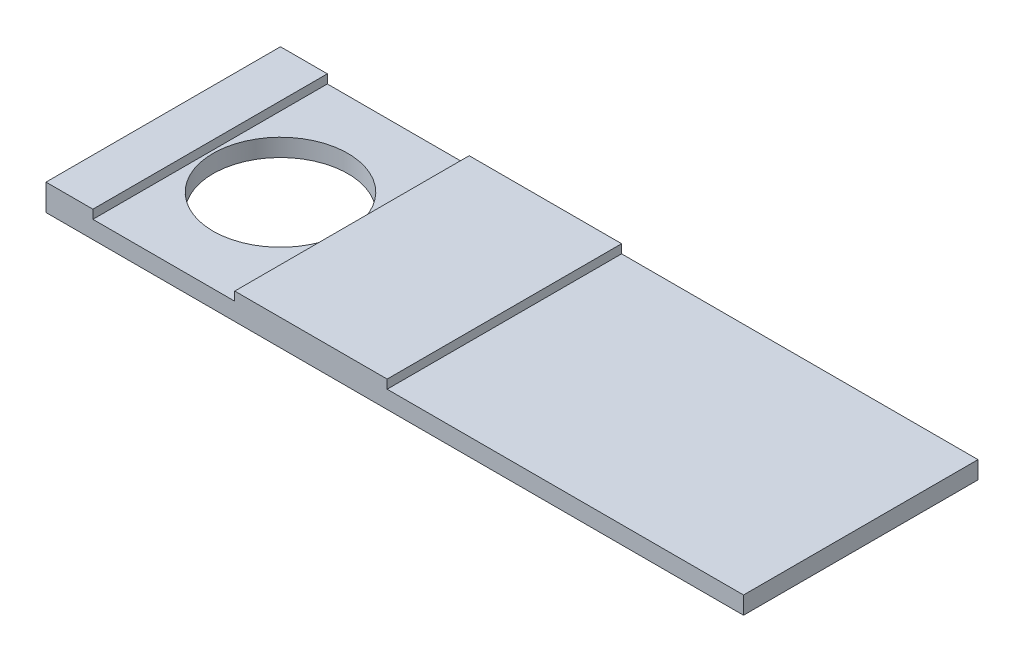
ISO-10303-21;
HEADER;
FILE_DESCRIPTION(('STEP AP214'),'2;1');
FILE_NAME('part.step','',(''),(''),'','','');
FILE_SCHEMA(('AUTOMOTIVE_DESIGN { 1 0 10303 214 1 1 1 1 }'));
ENDSEC;
DATA;
#1=APPLICATION_CONTEXT('core data for automotive mechanical design processes');
#2=APPLICATION_PROTOCOL_DEFINITION('international standard','automotive_design',2000,#1);
#3=PRODUCT_CONTEXT('',#1,'mechanical');
#4=PRODUCT('Part','Part','',(#3));
#5=PRODUCT_RELATED_PRODUCT_CATEGORY('part','',(#4));
#6=PRODUCT_DEFINITION_FORMATION('','',#4);
#7=PRODUCT_DEFINITION_CONTEXT('part definition',#1,'design');
#8=PRODUCT_DEFINITION('design','',#6,#7);
#9=PRODUCT_DEFINITION_SHAPE('','',#8);
#10=(LENGTH_UNIT() NAMED_UNIT(*) SI_UNIT(.MILLI.,.METRE.));
#11=(NAMED_UNIT(*) PLANE_ANGLE_UNIT() SI_UNIT($,.RADIAN.));
#12=(NAMED_UNIT(*) SI_UNIT($,.STERADIAN.) SOLID_ANGLE_UNIT());
#13=UNCERTAINTY_MEASURE_WITH_UNIT(LENGTH_MEASURE(1.E-05),#10,'distance_accuracy_value','');
#14=(GEOMETRIC_REPRESENTATION_CONTEXT(3) GLOBAL_UNCERTAINTY_ASSIGNED_CONTEXT((#13)) GLOBAL_UNIT_ASSIGNED_CONTEXT((#10,
#11,#12)) REPRESENTATION_CONTEXT('',''));
#15=CARTESIAN_POINT('',(0.,0.,0.));
#16=DIRECTION('',(0.,0.,1.));
#17=DIRECTION('',(1.,0.,0.));
#18=AXIS2_PLACEMENT_3D('',#15,#16,#17);
#19=CARTESIAN_POINT('',(0.,3.,0.));
#20=DIRECTION('',(0.,-1.,0.));
#21=DIRECTION('',(0.,0.,-1.));
#22=AXIS2_PLACEMENT_3D('',#19,#20,#21);
#23=PLANE('',#22);
#24=CARTESIAN_POINT('',(-39.5,3.,0.));
#25=DIRECTION('',(0.,1.,0.));
#26=DIRECTION('',(0.,0.,1.));
#27=AXIS2_PLACEMENT_3D('',#24,#25,#26);
#28=CIRCLE('',#27,11.5);
#29=CARTESIAN_POINT('',(-39.5,3.,11.5));
#30=VERTEX_POINT('',#29);
#31=EDGE_CURVE('E197',#30,#30,#28,.T.);
#32=ORIENTED_EDGE('',*,*,#31,.F.);
#33=EDGE_LOOP('',(#32));
#34=FACE_BOUND('',#33,.T.);
#35=DIRECTION('',(0.,0.,-1.));
#36=VECTOR('',#35,1.);
#37=CARTESIAN_POINT('',(-51.5,3.,-20.));
#38=LINE('',#37,#36);
#39=CARTESIAN_POINT('',(-51.5,3.,20.));
#40=VERTEX_POINT('',#39);
#41=CARTESIAN_POINT('',(-51.5,3.,-20.));
#42=VERTEX_POINT('',#41);
#43=EDGE_CURVE('E146',#40,#42,#38,.T.);
#44=ORIENTED_EDGE('',*,*,#43,.F.);
#45=DIRECTION('',(1.,0.,0.));
#46=VECTOR('',#45,1.);
#47=CARTESIAN_POINT('',(-59.5,3.,20.));
#48=LINE('',#47,#46);
#49=CARTESIAN_POINT('',(-27.3,3.,20.));
#50=VERTEX_POINT('',#49);
#51=EDGE_CURVE('E214',#40,#50,#48,.T.);
#52=ORIENTED_EDGE('',*,*,#51,.T.);
#53=DIRECTION('',(0.,0.,1.));
#54=VECTOR('',#53,1.);
#55=CARTESIAN_POINT('',(-27.3,3.,-20.));
#56=LINE('',#55,#54);
#57=CARTESIAN_POINT('',(-27.3,3.,-20.));
#58=VERTEX_POINT('',#57);
#59=EDGE_CURVE('E161',#58,#50,#56,.T.);
#60=ORIENTED_EDGE('',*,*,#59,.F.);
#61=DIRECTION('',(-1.,0.,0.));
#62=VECTOR('',#61,1.);
#63=CARTESIAN_POINT('',(-59.5,3.,-20.));
#64=LINE('',#63,#62);
#65=EDGE_CURVE('E55',#58,#42,#64,.T.);
#66=ORIENTED_EDGE('',*,*,#65,.T.);
#67=EDGE_LOOP('',(#44,#52,#60,#66));
#68=FACE_BOUND('',#67,.T.);
#69=ADVANCED_FACE('F39',(#34,#68),#23,.F.);
#70=DIRECTION('',(0.,0.,-1.));
#71=VECTOR('',#70,1.);
#72=CARTESIAN_POINT('',(-1.3,3.,-20.));
#73=LINE('',#72,#71);
#74=CARTESIAN_POINT('',(-1.3,3.,20.));
#75=VERTEX_POINT('',#74);
#76=CARTESIAN_POINT('',(-1.3,3.,-20.));
#77=VERTEX_POINT('',#76);
#78=EDGE_CURVE('E63',#75,#77,#73,.T.);
#79=ORIENTED_EDGE('',*,*,#78,.F.);
#80=CARTESIAN_POINT('',(59.5,3.,20.));
#81=VERTEX_POINT('',#80);
#82=EDGE_CURVE('E213',#75,#81,#48,.T.);
#83=ORIENTED_EDGE('',*,*,#82,.T.);
#84=DIRECTION('',(0.,0.,-1.));
#85=VECTOR('',#84,1.);
#86=CARTESIAN_POINT('',(59.5,3.,20.));
#87=LINE('',#86,#85);
#88=CARTESIAN_POINT('',(59.5,3.,-20.));
#89=VERTEX_POINT('',#88);
#90=EDGE_CURVE('E205',#81,#89,#87,.T.);
#91=ORIENTED_EDGE('',*,*,#90,.T.);
#92=EDGE_CURVE('E210',#89,#77,#64,.T.);
#93=ORIENTED_EDGE('',*,*,#92,.T.);
#94=EDGE_LOOP('',(#79,#83,#91,#93));
#95=FACE_BOUND('',#94,.T.);
#96=ADVANCED_FACE('F239',(#95),#23,.F.);
#97=CARTESIAN_POINT('',(0.,0.,0.));
#98=DIRECTION('',(0.,-1.,0.));
#99=DIRECTION('',(0.,0.,-1.));
#100=AXIS2_PLACEMENT_3D('',#97,#98,#99);
#101=PLANE('',#100);
#102=DIRECTION('',(0.,0.,-1.));
#103=VECTOR('',#102,1.);
#104=CARTESIAN_POINT('',(59.5,0.,20.));
#105=LINE('',#104,#103);
#106=CARTESIAN_POINT('',(59.5,0.,20.));
#107=VERTEX_POINT('',#106);
#108=CARTESIAN_POINT('',(59.5,0.,-20.));
#109=VERTEX_POINT('',#108);
#110=EDGE_CURVE('E201',#107,#109,#105,.T.);
#111=ORIENTED_EDGE('',*,*,#110,.F.);
#112=DIRECTION('',(1.,0.,0.));
#113=VECTOR('',#112,1.);
#114=CARTESIAN_POINT('',(-59.5,0.,20.));
#115=LINE('',#114,#113);
#116=CARTESIAN_POINT('',(-59.5,0.,20.));
#117=VERTEX_POINT('',#116);
#118=EDGE_CURVE('E209',#117,#107,#115,.T.);
#119=ORIENTED_EDGE('',*,*,#118,.F.);
#120=DIRECTION('',(0.,0.,1.));
#121=VECTOR('',#120,1.);
#122=CARTESIAN_POINT('',(-59.5,0.,20.));
#123=LINE('',#122,#121);
#124=CARTESIAN_POINT('',(-59.5,0.,-20.));
#125=VERTEX_POINT('',#124);
#126=EDGE_CURVE('E125',#125,#117,#123,.T.);
#127=ORIENTED_EDGE('',*,*,#126,.F.);
#128=DIRECTION('',(-1.,0.,0.));
#129=VECTOR('',#128,1.);
#130=CARTESIAN_POINT('',(-59.5,0.,-20.));
#131=LINE('',#130,#129);
#132=EDGE_CURVE('E220',#109,#125,#131,.T.);
#133=ORIENTED_EDGE('',*,*,#132,.F.);
#134=EDGE_LOOP('',(#111,#119,#127,#133));
#135=FACE_BOUND('',#134,.T.);
#136=CARTESIAN_POINT('',(-39.5,0.,0.));
#137=DIRECTION('',(0.,1.,0.));
#138=DIRECTION('',(0.,0.,1.));
#139=AXIS2_PLACEMENT_3D('',#136,#137,#138);
#140=CIRCLE('',#139,11.5);
#141=CARTESIAN_POINT('',(-39.5,0.,11.5));
#142=VERTEX_POINT('',#141);
#143=EDGE_CURVE('E196',#142,#142,#140,.T.);
#144=ORIENTED_EDGE('',*,*,#143,.T.);
#145=EDGE_LOOP('',(#144));
#146=FACE_BOUND('',#145,.T.);
#147=ADVANCED_FACE('F233',(#135,#146),#101,.T.);
#148=CARTESIAN_POINT('',(59.5,3.,20.));
#149=DIRECTION('',(-1.,0.,0.));
#150=DIRECTION('',(0.,0.,1.));
#151=AXIS2_PLACEMENT_3D('',#148,#149,#150);
#152=PLANE('',#151);
#153=ORIENTED_EDGE('',*,*,#110,.T.);
#154=DIRECTION('',(0.,-1.,0.));
#155=VECTOR('',#154,1.);
#156=CARTESIAN_POINT('',(59.5,3.,-20.));
#157=LINE('',#156,#155);
#158=EDGE_CURVE('E11',#89,#109,#157,.T.);
#159=ORIENTED_EDGE('',*,*,#158,.F.);
#160=ORIENTED_EDGE('',*,*,#90,.F.);
#161=DIRECTION('',(0.,-1.,0.));
#162=VECTOR('',#161,1.);
#163=CARTESIAN_POINT('',(59.5,3.,20.));
#164=LINE('',#163,#162);
#165=EDGE_CURVE('E129',#81,#107,#164,.T.);
#166=ORIENTED_EDGE('',*,*,#165,.T.);
#167=EDGE_LOOP('',(#153,#159,#160,#166));
#168=FACE_BOUND('',#167,.T.);
#169=ADVANCED_FACE('F41',(#168),#152,.F.);
#170=CARTESIAN_POINT('',(-59.5,3.,-20.));
#171=DIRECTION('',(0.,0.,1.));
#172=DIRECTION('',(1.,0.,0.));
#173=AXIS2_PLACEMENT_3D('',#170,#171,#172);
#174=PLANE('',#173);
#175=ORIENTED_EDGE('',*,*,#132,.T.);
#176=DIRECTION('',(0.,-1.,0.));
#177=VECTOR('',#176,1.);
#178=CARTESIAN_POINT('',(-59.5,3.,-20.));
#179=LINE('',#178,#177);
#180=CARTESIAN_POINT('',(-59.5,4.5,-20.));
#181=VERTEX_POINT('',#180);
#182=EDGE_CURVE('E48',#181,#125,#179,.T.);
#183=ORIENTED_EDGE('',*,*,#182,.F.);
#184=DIRECTION('',(-1.,0.,0.));
#185=VECTOR('',#184,1.);
#186=CARTESIAN_POINT('',(-59.5,4.5,-20.));
#187=LINE('',#186,#185);
#188=CARTESIAN_POINT('',(-51.5,4.5,-20.));
#189=VERTEX_POINT('',#188);
#190=EDGE_CURVE('E144',#189,#181,#187,.T.);
#191=ORIENTED_EDGE('',*,*,#190,.F.);
#192=DIRECTION('',(0.,-1.,0.));
#193=VECTOR('',#192,1.);
#194=CARTESIAN_POINT('',(-51.5,4.5,-20.));
#195=LINE('',#194,#193);
#196=EDGE_CURVE('E154',#189,#42,#195,.T.);
#197=ORIENTED_EDGE('',*,*,#196,.T.);
#198=ORIENTED_EDGE('',*,*,#65,.F.);
#199=DIRECTION('',(0.,-1.,0.));
#200=VECTOR('',#199,1.);
#201=CARTESIAN_POINT('',(-27.3,4.5,-20.));
#202=LINE('',#201,#200);
#203=CARTESIAN_POINT('',(-27.3,4.5,-20.));
#204=VERTEX_POINT('',#203);
#205=EDGE_CURVE('E175',#204,#58,#202,.T.);
#206=ORIENTED_EDGE('',*,*,#205,.F.);
#207=DIRECTION('',(-1.,0.,0.));
#208=VECTOR('',#207,1.);
#209=CARTESIAN_POINT('',(-27.3,4.5,-20.));
#210=LINE('',#209,#208);
#211=CARTESIAN_POINT('',(-1.3,4.5,-20.));
#212=VERTEX_POINT('',#211);
#213=EDGE_CURVE('E172',#212,#204,#210,.T.);
#214=ORIENTED_EDGE('',*,*,#213,.F.);
#215=DIRECTION('',(0.,-1.,0.));
#216=VECTOR('',#215,1.);
#217=CARTESIAN_POINT('',(-1.3,4.5,-20.));
#218=LINE('',#217,#216);
#219=EDGE_CURVE('E184',#212,#77,#218,.T.);
#220=ORIENTED_EDGE('',*,*,#219,.T.);
#221=ORIENTED_EDGE('',*,*,#92,.F.);
#222=ORIENTED_EDGE('',*,*,#158,.T.);
#223=EDGE_LOOP('',(#175,#183,#191,#197,#198,#206,#214,#220,#221,#222));
#224=FACE_BOUND('',#223,.T.);
#225=ADVANCED_FACE('F255',(#224),#174,.F.);
#226=CARTESIAN_POINT('',(-59.5,3.,20.));
#227=DIRECTION('',(1.,0.,0.));
#228=DIRECTION('',(0.,0.,-1.));
#229=AXIS2_PLACEMENT_3D('',#226,#227,#228);
#230=PLANE('',#229);
#231=ORIENTED_EDGE('',*,*,#126,.T.);
#232=DIRECTION('',(0.,-1.,0.));
#233=VECTOR('',#232,1.);
#234=CARTESIAN_POINT('',(-59.5,3.,20.));
#235=LINE('',#234,#233);
#236=CARTESIAN_POINT('',(-59.5,4.5,20.));
#237=VERTEX_POINT('',#236);
#238=EDGE_CURVE('E118',#237,#117,#235,.T.);
#239=ORIENTED_EDGE('',*,*,#238,.F.);
#240=DIRECTION('',(0.,0.,1.));
#241=VECTOR('',#240,1.);
#242=CARTESIAN_POINT('',(-59.5,4.5,-20.));
#243=LINE('',#242,#241);
#244=EDGE_CURVE('E123',#181,#237,#243,.T.);
#245=ORIENTED_EDGE('',*,*,#244,.F.);
#246=ORIENTED_EDGE('',*,*,#182,.T.);
#247=EDGE_LOOP('',(#231,#239,#245,#246));
#248=FACE_BOUND('',#247,.T.);
#249=ADVANCED_FACE('F120',(#248),#230,.F.);
#250=CARTESIAN_POINT('',(-59.5,3.,20.));
#251=DIRECTION('',(0.,0.,-1.));
#252=DIRECTION('',(-1.,0.,0.));
#253=AXIS2_PLACEMENT_3D('',#250,#251,#252);
#254=PLANE('',#253);
#255=ORIENTED_EDGE('',*,*,#118,.T.);
#256=ORIENTED_EDGE('',*,*,#165,.F.);
#257=ORIENTED_EDGE('',*,*,#82,.F.);
#258=DIRECTION('',(0.,-1.,0.));
#259=VECTOR('',#258,1.);
#260=CARTESIAN_POINT('',(-1.3,4.5,20.));
#261=LINE('',#260,#259);
#262=CARTESIAN_POINT('',(-1.3,4.5,20.));
#263=VERTEX_POINT('',#262);
#264=EDGE_CURVE('E188',#263,#75,#261,.T.);
#265=ORIENTED_EDGE('',*,*,#264,.F.);
#266=DIRECTION('',(1.,0.,0.));
#267=VECTOR('',#266,1.);
#268=CARTESIAN_POINT('',(-27.3,4.5,20.));
#269=LINE('',#268,#267);
#270=CARTESIAN_POINT('',(-27.3,4.5,20.));
#271=VERTEX_POINT('',#270);
#272=EDGE_CURVE('E166',#271,#263,#269,.T.);
#273=ORIENTED_EDGE('',*,*,#272,.F.);
#274=DIRECTION('',(0.,-1.,0.));
#275=VECTOR('',#274,1.);
#276=CARTESIAN_POINT('',(-27.3,4.5,20.));
#277=LINE('',#276,#275);
#278=EDGE_CURVE('E192',#271,#50,#277,.T.);
#279=ORIENTED_EDGE('',*,*,#278,.T.);
#280=ORIENTED_EDGE('',*,*,#51,.F.);
#281=DIRECTION('',(0.,-1.,0.));
#282=VECTOR('',#281,1.);
#283=CARTESIAN_POINT('',(-51.5,4.5,20.));
#284=LINE('',#283,#282);
#285=CARTESIAN_POINT('',(-51.5,4.5,20.));
#286=VERTEX_POINT('',#285);
#287=EDGE_CURVE('E135',#286,#40,#284,.T.);
#288=ORIENTED_EDGE('',*,*,#287,.F.);
#289=DIRECTION('',(1.,0.,0.));
#290=VECTOR('',#289,1.);
#291=CARTESIAN_POINT('',(-59.5,4.5,20.));
#292=LINE('',#291,#290);
#293=EDGE_CURVE('E132',#237,#286,#292,.T.);
#294=ORIENTED_EDGE('',*,*,#293,.F.);
#295=ORIENTED_EDGE('',*,*,#238,.T.);
#296=EDGE_LOOP('',(#255,#256,#257,#265,#273,#279,#280,#288,#294,#295));
#297=FACE_BOUND('',#296,.T.);
#298=ADVANCED_FACE('F133',(#297),#254,.F.);
#299=CARTESIAN_POINT('',(-39.5,3.,0.));
#300=DIRECTION('',(0.,-1.,0.));
#301=DIRECTION('',(0.,0.,-1.));
#302=AXIS2_PLACEMENT_3D('',#299,#300,#301);
#303=CYLINDRICAL_SURFACE('',#302,11.5);
#304=ORIENTED_EDGE('',*,*,#31,.T.);
#305=EDGE_LOOP('',(#304));
#306=FACE_BOUND('',#305,.T.);
#307=ORIENTED_EDGE('',*,*,#143,.F.);
#308=EDGE_LOOP('',(#307));
#309=FACE_BOUND('',#308,.T.);
#310=ADVANCED_FACE('F276',(#306,#309),#303,.F.);
#311=CARTESIAN_POINT('',(-27.3,4.5,-20.));
#312=DIRECTION('',(1.,0.,0.));
#313=DIRECTION('',(0.,0.,-1.));
#314=AXIS2_PLACEMENT_3D('',#311,#312,#313);
#315=PLANE('',#314);
#316=ORIENTED_EDGE('',*,*,#59,.T.);
#317=ORIENTED_EDGE('',*,*,#278,.F.);
#318=DIRECTION('',(0.,0.,1.));
#319=VECTOR('',#318,1.);
#320=CARTESIAN_POINT('',(-27.3,4.5,-20.));
#321=LINE('',#320,#319);
#322=EDGE_CURVE('E162',#204,#271,#321,.T.);
#323=ORIENTED_EDGE('',*,*,#322,.F.);
#324=ORIENTED_EDGE('',*,*,#205,.T.);
#325=EDGE_LOOP('',(#316,#317,#323,#324));
#326=FACE_BOUND('',#325,.T.);
#327=ADVANCED_FACE('F254',(#326),#315,.F.);
#328=CARTESIAN_POINT('',(-1.3,4.5,-20.));
#329=DIRECTION('',(-1.,0.,0.));
#330=DIRECTION('',(0.,0.,1.));
#331=AXIS2_PLACEMENT_3D('',#328,#329,#330);
#332=PLANE('',#331);
#333=ORIENTED_EDGE('',*,*,#78,.T.);
#334=ORIENTED_EDGE('',*,*,#219,.F.);
#335=DIRECTION('',(0.,0.,-1.));
#336=VECTOR('',#335,1.);
#337=CARTESIAN_POINT('',(-1.3,4.5,-20.));
#338=LINE('',#337,#336);
#339=EDGE_CURVE('E169',#263,#212,#338,.T.);
#340=ORIENTED_EDGE('',*,*,#339,.F.);
#341=ORIENTED_EDGE('',*,*,#264,.T.);
#342=EDGE_LOOP('',(#333,#334,#340,#341));
#343=FACE_BOUND('',#342,.T.);
#344=ADVANCED_FACE('F245',(#343),#332,.F.);
#345=CARTESIAN_POINT('',(0.,4.5,0.));
#346=DIRECTION('',(0.,1.,0.));
#347=DIRECTION('',(0.,0.,1.));
#348=AXIS2_PLACEMENT_3D('',#345,#346,#347);
#349=PLANE('',#348);
#350=ORIENTED_EDGE('',*,*,#322,.T.);
#351=ORIENTED_EDGE('',*,*,#272,.T.);
#352=ORIENTED_EDGE('',*,*,#339,.T.);
#353=ORIENTED_EDGE('',*,*,#213,.T.);
#354=EDGE_LOOP('',(#350,#351,#352,#353));
#355=FACE_BOUND('',#354,.T.);
#356=ADVANCED_FACE('F249',(#355),#349,.T.);
#357=CARTESIAN_POINT('',(-51.5,4.5,-20.));
#358=DIRECTION('',(-1.,0.,0.));
#359=DIRECTION('',(0.,0.,1.));
#360=AXIS2_PLACEMENT_3D('',#357,#358,#359);
#361=PLANE('',#360);
#362=ORIENTED_EDGE('',*,*,#43,.T.);
#363=ORIENTED_EDGE('',*,*,#196,.F.);
#364=DIRECTION('',(0.,0.,-1.));
#365=VECTOR('',#364,1.);
#366=CARTESIAN_POINT('',(-51.5,4.5,-20.));
#367=LINE('',#366,#365);
#368=EDGE_CURVE('E139',#286,#189,#367,.T.);
#369=ORIENTED_EDGE('',*,*,#368,.F.);
#370=ORIENTED_EDGE('',*,*,#287,.T.);
#371=EDGE_LOOP('',(#362,#363,#369,#370));
#372=FACE_BOUND('',#371,.T.);
#373=ADVANCED_FACE('F258',(#372),#361,.F.);
#374=CARTESIAN_POINT('',(0.,4.5,0.));
#375=DIRECTION('',(0.,1.,0.));
#376=DIRECTION('',(0.,0.,1.));
#377=AXIS2_PLACEMENT_3D('',#374,#375,#376);
#378=PLANE('',#377);
#379=ORIENTED_EDGE('',*,*,#244,.T.);
#380=ORIENTED_EDGE('',*,*,#293,.T.);
#381=ORIENTED_EDGE('',*,*,#368,.T.);
#382=ORIENTED_EDGE('',*,*,#190,.T.);
#383=EDGE_LOOP('',(#379,#380,#381,#382));
#384=FACE_BOUND('',#383,.T.);
#385=ADVANCED_FACE('F142',(#384),#378,.T.);
#386=CLOSED_SHELL('',(#69,#96,#147,#169,#225,#249,#298,#310,#327,#344,#356,#373,#385));
#387=MANIFOLD_SOLID_BREP('B2',#386);
#388=ADVANCED_BREP_SHAPE_REPRESENTATION('',(#18,#387),#14);
#389=SHAPE_DEFINITION_REPRESENTATION(#9,#388);
ENDSEC;
END-ISO-10303-21;
